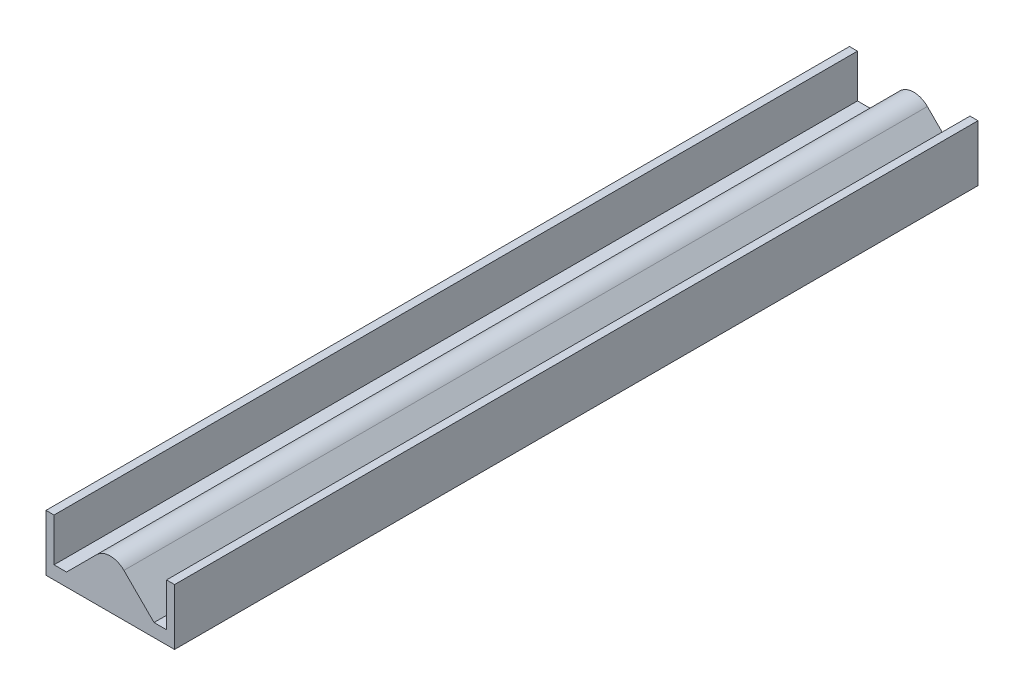
ISO-10303-21;
HEADER;
FILE_DESCRIPTION(('STEP AP214'),'2;1');
FILE_NAME('part.step','',(''),(''),'','','');
FILE_SCHEMA(('AUTOMOTIVE_DESIGN { 1 0 10303 214 1 1 1 1 }'));
ENDSEC;
DATA;
#1=APPLICATION_CONTEXT('core data for automotive mechanical design processes');
#2=APPLICATION_PROTOCOL_DEFINITION('international standard','automotive_design',2000,#1);
#3=PRODUCT_CONTEXT('',#1,'mechanical');
#4=PRODUCT('Part','Part','',(#3));
#5=PRODUCT_RELATED_PRODUCT_CATEGORY('part','',(#4));
#6=PRODUCT_DEFINITION_FORMATION('','',#4);
#7=PRODUCT_DEFINITION_CONTEXT('part definition',#1,'design');
#8=PRODUCT_DEFINITION('design','',#6,#7);
#9=PRODUCT_DEFINITION_SHAPE('','',#8);
#10=(LENGTH_UNIT() NAMED_UNIT(*) SI_UNIT(.MILLI.,.METRE.));
#11=(NAMED_UNIT(*) PLANE_ANGLE_UNIT() SI_UNIT($,.RADIAN.));
#12=(NAMED_UNIT(*) SI_UNIT($,.STERADIAN.) SOLID_ANGLE_UNIT());
#13=UNCERTAINTY_MEASURE_WITH_UNIT(LENGTH_MEASURE(1.E-05),#10,'distance_accuracy_value','');
#14=(GEOMETRIC_REPRESENTATION_CONTEXT(3) GLOBAL_UNCERTAINTY_ASSIGNED_CONTEXT((#13)) GLOBAL_UNIT_ASSIGNED_CONTEXT((#10,
#11,#12)) REPRESENTATION_CONTEXT('',''));
#15=CARTESIAN_POINT('',(0.,0.,0.));
#16=DIRECTION('',(0.,0.,1.));
#17=DIRECTION('',(1.,0.,0.));
#18=AXIS2_PLACEMENT_3D('',#15,#16,#17);
#19=CARTESIAN_POINT('',(40.,-18.75,500.));
#20=DIRECTION('',(0.,1.,0.));
#21=DIRECTION('',(-1.,0.,0.));
#22=AXIS2_PLACEMENT_3D('',#19,#20,#21);
#23=PLANE('',#22);
#24=DIRECTION('',(1.,0.,0.));
#25=VECTOR('',#24,1.);
#26=CARTESIAN_POINT('',(40.,-18.75,0.));
#27=LINE('',#26,#25);
#28=CARTESIAN_POINT('',(-40.,-18.75,0.));
#29=VERTEX_POINT('',#28);
#30=CARTESIAN_POINT('',(40.,-18.75,0.));
#31=VERTEX_POINT('',#30);
#32=EDGE_CURVE('E145',#29,#31,#27,.T.);
#33=ORIENTED_EDGE('',*,*,#32,.T.);
#34=DIRECTION('',(0.,0.,-1.));
#35=VECTOR('',#34,1.);
#36=CARTESIAN_POINT('',(40.,-18.75,500.));
#37=LINE('',#36,#35);
#38=CARTESIAN_POINT('',(40.,-18.75,500.));
#39=VERTEX_POINT('',#38);
#40=EDGE_CURVE('E126',#39,#31,#37,.T.);
#41=ORIENTED_EDGE('',*,*,#40,.F.);
#42=DIRECTION('',(1.,0.,0.));
#43=VECTOR('',#42,1.);
#44=CARTESIAN_POINT('',(40.,-18.75,500.));
#45=LINE('',#44,#43);
#46=CARTESIAN_POINT('',(-40.,-18.75,500.));
#47=VERTEX_POINT('',#46);
#48=EDGE_CURVE('E133',#47,#39,#45,.T.);
#49=ORIENTED_EDGE('',*,*,#48,.F.);
#50=DIRECTION('',(0.,0.,-1.));
#51=VECTOR('',#50,1.);
#52=CARTESIAN_POINT('',(-40.,-18.75,500.));
#53=LINE('',#52,#51);
#54=EDGE_CURVE('E174',#47,#29,#53,.T.);
#55=ORIENTED_EDGE('',*,*,#54,.T.);
#56=EDGE_LOOP('',(#33,#41,#49,#55));
#57=FACE_BOUND('',#56,.T.);
#58=ADVANCED_FACE('F33',(#57),#23,.F.);
#59=CARTESIAN_POINT('',(40.,16.25,500.));
#60=DIRECTION('',(-1.,0.,0.));
#61=DIRECTION('',(0.,-1.,0.));
#62=AXIS2_PLACEMENT_3D('',#59,#60,#61);
#63=PLANE('',#62);
#64=DIRECTION('',(0.,1.,0.));
#65=VECTOR('',#64,1.);
#66=CARTESIAN_POINT('',(40.,16.25,0.));
#67=LINE('',#66,#65);
#68=CARTESIAN_POINT('',(40.,16.25,0.));
#69=VERTEX_POINT('',#68);
#70=EDGE_CURVE('E193',#31,#69,#67,.T.);
#71=ORIENTED_EDGE('',*,*,#70,.T.);
#72=DIRECTION('',(0.,0.,-1.));
#73=VECTOR('',#72,1.);
#74=CARTESIAN_POINT('',(40.,16.25,500.));
#75=LINE('',#74,#73);
#76=CARTESIAN_POINT('',(40.,16.25,500.));
#77=VERTEX_POINT('',#76);
#78=EDGE_CURVE('E129',#77,#69,#75,.T.);
#79=ORIENTED_EDGE('',*,*,#78,.F.);
#80=DIRECTION('',(0.,1.,0.));
#81=VECTOR('',#80,1.);
#82=CARTESIAN_POINT('',(40.,16.25,500.));
#83=LINE('',#82,#81);
#84=EDGE_CURVE('E122',#39,#77,#83,.T.);
#85=ORIENTED_EDGE('',*,*,#84,.F.);
#86=ORIENTED_EDGE('',*,*,#40,.T.);
#87=EDGE_LOOP('',(#71,#79,#85,#86));
#88=FACE_BOUND('',#87,.T.);
#89=ADVANCED_FACE('F124',(#88),#63,.F.);
#90=CARTESIAN_POINT('',(35.,16.25,500.));
#91=DIRECTION('',(0.,-1.,0.));
#92=DIRECTION('',(0.,0.,-1.));
#93=AXIS2_PLACEMENT_3D('',#90,#91,#92);
#94=PLANE('',#93);
#95=DIRECTION('',(-1.,0.,0.));
#96=VECTOR('',#95,1.);
#97=CARTESIAN_POINT('',(35.,16.25,0.));
#98=LINE('',#97,#96);
#99=CARTESIAN_POINT('',(35.,16.25,0.));
#100=VERTEX_POINT('',#99);
#101=EDGE_CURVE('E191',#69,#100,#98,.T.);
#102=ORIENTED_EDGE('',*,*,#101,.T.);
#103=DIRECTION('',(0.,0.,-1.));
#104=VECTOR('',#103,1.);
#105=CARTESIAN_POINT('',(35.,16.25,500.));
#106=LINE('',#105,#104);
#107=CARTESIAN_POINT('',(35.,16.25,500.));
#108=VERTEX_POINT('',#107);
#109=EDGE_CURVE('E150',#108,#100,#106,.T.);
#110=ORIENTED_EDGE('',*,*,#109,.F.);
#111=DIRECTION('',(-1.,0.,0.));
#112=VECTOR('',#111,1.);
#113=CARTESIAN_POINT('',(35.,16.25,500.));
#114=LINE('',#113,#112);
#115=EDGE_CURVE('E132',#77,#108,#114,.T.);
#116=ORIENTED_EDGE('',*,*,#115,.F.);
#117=ORIENTED_EDGE('',*,*,#78,.T.);
#118=EDGE_LOOP('',(#102,#110,#116,#117));
#119=FACE_BOUND('',#118,.T.);
#120=ADVANCED_FACE('F215',(#119),#94,.F.);
#121=CARTESIAN_POINT('',(35.,16.25,500.));
#122=DIRECTION('',(1.,0.,0.));
#123=DIRECTION('',(0.,0.,-1.));
#124=AXIS2_PLACEMENT_3D('',#121,#122,#123);
#125=PLANE('',#124);
#126=DIRECTION('',(0.,-1.,0.));
#127=VECTOR('',#126,1.);
#128=CARTESIAN_POINT('',(35.,16.25,0.));
#129=LINE('',#128,#127);
#130=CARTESIAN_POINT('',(35.,-10.5949314192417,0.));
#131=VERTEX_POINT('',#130);
#132=EDGE_CURVE('E189',#100,#131,#129,.T.);
#133=ORIENTED_EDGE('',*,*,#132,.T.);
#134=DIRECTION('',(0.,0.,-1.));
#135=VECTOR('',#134,1.);
#136=CARTESIAN_POINT('',(35.,-10.5949314192417,500.));
#137=LINE('',#136,#135);
#138=CARTESIAN_POINT('',(35.,-10.5949314192417,500.));
#139=VERTEX_POINT('',#138);
#140=EDGE_CURVE('E156',#139,#131,#137,.T.);
#141=ORIENTED_EDGE('',*,*,#140,.F.);
#142=DIRECTION('',(0.,-1.,0.));
#143=VECTOR('',#142,1.);
#144=CARTESIAN_POINT('',(35.,16.25,500.));
#145=LINE('',#144,#143);
#146=EDGE_CURVE('E209',#108,#139,#145,.T.);
#147=ORIENTED_EDGE('',*,*,#146,.F.);
#148=ORIENTED_EDGE('',*,*,#109,.T.);
#149=EDGE_LOOP('',(#133,#141,#147,#148));
#150=FACE_BOUND('',#149,.T.);
#151=ADVANCED_FACE('F219',(#150),#125,.F.);
#152=CARTESIAN_POINT('',(35.,-10.5949314192417,500.));
#153=DIRECTION('',(0.,-1.,0.));
#154=DIRECTION('',(0.,0.,-1.));
#155=AXIS2_PLACEMENT_3D('',#152,#153,#154);
#156=PLANE('',#155);
#157=DIRECTION('',(-1.,0.,0.));
#158=VECTOR('',#157,1.);
#159=CARTESIAN_POINT('',(35.,-10.5949314192417,0.));
#160=LINE('',#159,#158);
#161=CARTESIAN_POINT('',(27.2236110756821,-10.5949314192417,0.));
#162=VERTEX_POINT('',#161);
#163=EDGE_CURVE('E187',#131,#162,#160,.T.);
#164=ORIENTED_EDGE('',*,*,#163,.T.);
#165=DIRECTION('',(0.,0.,-1.));
#166=VECTOR('',#165,1.);
#167=CARTESIAN_POINT('',(27.2236110756821,-10.5949314192417,500.));
#168=LINE('',#167,#166);
#169=CARTESIAN_POINT('',(27.2236110756821,-10.5949314192417,500.));
#170=VERTEX_POINT('',#169);
#171=EDGE_CURVE('E159',#170,#162,#168,.T.);
#172=ORIENTED_EDGE('',*,*,#171,.F.);
#173=DIRECTION('',(-1.,0.,0.));
#174=VECTOR('',#173,1.);
#175=CARTESIAN_POINT('',(35.,-10.5949314192417,500.));
#176=LINE('',#175,#174);
#177=EDGE_CURVE('E207',#139,#170,#176,.T.);
#178=ORIENTED_EDGE('',*,*,#177,.F.);
#179=ORIENTED_EDGE('',*,*,#140,.T.);
#180=EDGE_LOOP('',(#164,#172,#178,#179));
#181=FACE_BOUND('',#180,.T.);
#182=ADVANCED_FACE('F224',(#181),#156,.F.);
#183=CARTESIAN_POINT('',(0.,16.6286796564404,500.));
#184=DIRECTION('',(-0.707106781186548,-0.707106781186548,0.));
#185=DIRECTION('',(0.707106781186548,-0.707106781186548,0.));
#186=AXIS2_PLACEMENT_3D('',#183,#184,#185);
#187=PLANE('',#186);
#188=DIRECTION('',(-0.707106781186547,0.707106781186547,0.));
#189=VECTOR('',#188,1.);
#190=CARTESIAN_POINT('',(0.,16.6286796564404,0.));
#191=LINE('',#190,#189);
#192=CARTESIAN_POINT('',(8.48528137423868,8.14339828220171,0.));
#193=VERTEX_POINT('',#192);
#194=EDGE_CURVE('E185',#162,#193,#191,.T.);
#195=ORIENTED_EDGE('',*,*,#194,.T.);
#196=DIRECTION('',(0.,0.,-1.));
#197=VECTOR('',#196,1.);
#198=CARTESIAN_POINT('',(8.48528137423868,8.14339828220171,500.));
#199=LINE('',#198,#197);
#200=CARTESIAN_POINT('',(8.48528137423868,8.14339828220171,500.));
#201=VERTEX_POINT('',#200);
#202=EDGE_CURVE('E41',#193,#201,#199,.F.);
#203=ORIENTED_EDGE('',*,*,#202,.T.);
#204=DIRECTION('',(-0.707106781186547,0.707106781186547,0.));
#205=VECTOR('',#204,1.);
#206=CARTESIAN_POINT('',(0.,16.6286796564404,500.));
#207=LINE('',#206,#205);
#208=EDGE_CURVE('E205',#170,#201,#207,.T.);
#209=ORIENTED_EDGE('',*,*,#208,.F.);
#210=ORIENTED_EDGE('',*,*,#171,.T.);
#211=EDGE_LOOP('',(#195,#203,#209,#210));
#212=FACE_BOUND('',#211,.T.);
#213=ADVANCED_FACE('F251',(#212),#187,.F.);
#214=CARTESIAN_POINT('',(0.,16.6286796564404,500.));
#215=DIRECTION('',(0.707106781186554,-0.707106781186541,0.));
#216=DIRECTION('',(0.707106781186541,0.707106781186554,0.));
#217=AXIS2_PLACEMENT_3D('',#214,#215,#216);
#218=PLANE('',#217);
#219=DIRECTION('',(-0.707106781186541,-0.707106781186554,0.));
#220=VECTOR('',#219,1.);
#221=CARTESIAN_POINT('',(0.,16.6286796564404,500.));
#222=LINE('',#221,#220);
#223=CARTESIAN_POINT('',(-8.48528137423853,8.14339828220163,500.));
#224=VERTEX_POINT('',#223);
#225=CARTESIAN_POINT('',(-27.2236110756818,-10.594931419242,500.));
#226=VERTEX_POINT('',#225);
#227=EDGE_CURVE('E203',#224,#226,#222,.T.);
#228=ORIENTED_EDGE('',*,*,#227,.F.);
#229=DIRECTION('',(0.,0.,-1.));
#230=VECTOR('',#229,1.);
#231=CARTESIAN_POINT('',(-8.48528137423854,8.14339828220163,500.));
#232=LINE('',#231,#230);
#233=CARTESIAN_POINT('',(-8.48528137423853,8.14339828220163,0.));
#234=VERTEX_POINT('',#233);
#235=EDGE_CURVE('E146',#224,#234,#232,.T.);
#236=ORIENTED_EDGE('',*,*,#235,.T.);
#237=DIRECTION('',(-0.707106781186541,-0.707106781186554,0.));
#238=VECTOR('',#237,1.);
#239=CARTESIAN_POINT('',(0.,16.6286796564404,0.));
#240=LINE('',#239,#238);
#241=CARTESIAN_POINT('',(-27.2236110756818,-10.594931419242,0.));
#242=VERTEX_POINT('',#241);
#243=EDGE_CURVE('E183',#234,#242,#240,.T.);
#244=ORIENTED_EDGE('',*,*,#243,.T.);
#245=DIRECTION('',(0.,0.,-1.));
#246=VECTOR('',#245,1.);
#247=CARTESIAN_POINT('',(-27.2236110756818,-10.594931419242,500.));
#248=LINE('',#247,#246);
#249=EDGE_CURVE('E162',#226,#242,#248,.T.);
#250=ORIENTED_EDGE('',*,*,#249,.F.);
#251=EDGE_LOOP('',(#228,#236,#244,#250));
#252=FACE_BOUND('',#251,.T.);
#253=ADVANCED_FACE('F230',(#252),#218,.F.);
#254=CARTESIAN_POINT('',(-35.,-10.594931419242,500.));
#255=DIRECTION('',(0.,-1.,0.));
#256=DIRECTION('',(0.,0.,-1.));
#257=AXIS2_PLACEMENT_3D('',#254,#255,#256);
#258=PLANE('',#257);
#259=DIRECTION('',(-1.,0.,0.));
#260=VECTOR('',#259,1.);
#261=CARTESIAN_POINT('',(-35.,-10.594931419242,0.));
#262=LINE('',#261,#260);
#263=CARTESIAN_POINT('',(-35.,-10.594931419242,0.));
#264=VERTEX_POINT('',#263);
#265=EDGE_CURVE('E181',#242,#264,#262,.T.);
#266=ORIENTED_EDGE('',*,*,#265,.T.);
#267=DIRECTION('',(0.,0.,-1.));
#268=VECTOR('',#267,1.);
#269=CARTESIAN_POINT('',(-35.,-10.594931419242,500.));
#270=LINE('',#269,#268);
#271=CARTESIAN_POINT('',(-35.,-10.594931419242,500.));
#272=VERTEX_POINT('',#271);
#273=EDGE_CURVE('E165',#272,#264,#270,.T.);
#274=ORIENTED_EDGE('',*,*,#273,.F.);
#275=DIRECTION('',(-1.,0.,0.));
#276=VECTOR('',#275,1.);
#277=CARTESIAN_POINT('',(-35.,-10.594931419242,500.));
#278=LINE('',#277,#276);
#279=EDGE_CURVE('E201',#226,#272,#278,.T.);
#280=ORIENTED_EDGE('',*,*,#279,.F.);
#281=ORIENTED_EDGE('',*,*,#249,.T.);
#282=EDGE_LOOP('',(#266,#274,#280,#281));
#283=FACE_BOUND('',#282,.T.);
#284=ADVANCED_FACE('F238',(#283),#258,.F.);
#285=CARTESIAN_POINT('',(-35.,16.25,500.));
#286=DIRECTION('',(-1.,0.,0.));
#287=DIRECTION('',(0.,0.,1.));
#288=AXIS2_PLACEMENT_3D('',#285,#286,#287);
#289=PLANE('',#288);
#290=DIRECTION('',(0.,1.,0.));
#291=VECTOR('',#290,1.);
#292=CARTESIAN_POINT('',(-35.,16.25,0.));
#293=LINE('',#292,#291);
#294=CARTESIAN_POINT('',(-35.,16.25,0.));
#295=VERTEX_POINT('',#294);
#296=EDGE_CURVE('E179',#264,#295,#293,.T.);
#297=ORIENTED_EDGE('',*,*,#296,.T.);
#298=DIRECTION('',(0.,0.,-1.));
#299=VECTOR('',#298,1.);
#300=CARTESIAN_POINT('',(-35.,16.25,500.));
#301=LINE('',#300,#299);
#302=CARTESIAN_POINT('',(-35.,16.25,500.));
#303=VERTEX_POINT('',#302);
#304=EDGE_CURVE('E168',#303,#295,#301,.T.);
#305=ORIENTED_EDGE('',*,*,#304,.F.);
#306=DIRECTION('',(0.,1.,0.));
#307=VECTOR('',#306,1.);
#308=CARTESIAN_POINT('',(-35.,16.25,500.));
#309=LINE('',#308,#307);
#310=EDGE_CURVE('E199',#272,#303,#309,.T.);
#311=ORIENTED_EDGE('',*,*,#310,.F.);
#312=ORIENTED_EDGE('',*,*,#273,.T.);
#313=EDGE_LOOP('',(#297,#305,#311,#312));
#314=FACE_BOUND('',#313,.T.);
#315=ADVANCED_FACE('F242',(#314),#289,.F.);
#316=CARTESIAN_POINT('',(-35.,16.25,500.));
#317=DIRECTION('',(0.,-1.,0.));
#318=DIRECTION('',(0.,0.,-1.));
#319=AXIS2_PLACEMENT_3D('',#316,#317,#318);
#320=PLANE('',#319);
#321=DIRECTION('',(-1.,0.,0.));
#322=VECTOR('',#321,1.);
#323=CARTESIAN_POINT('',(-35.,16.25,0.));
#324=LINE('',#323,#322);
#325=CARTESIAN_POINT('',(-40.,16.25,0.));
#326=VERTEX_POINT('',#325);
#327=EDGE_CURVE('E177',#295,#326,#324,.T.);
#328=ORIENTED_EDGE('',*,*,#327,.T.);
#329=DIRECTION('',(0.,0.,-1.));
#330=VECTOR('',#329,1.);
#331=CARTESIAN_POINT('',(-40.,16.25,500.));
#332=LINE('',#331,#330);
#333=CARTESIAN_POINT('',(-40.,16.25,500.));
#334=VERTEX_POINT('',#333);
#335=EDGE_CURVE('E171',#334,#326,#332,.T.);
#336=ORIENTED_EDGE('',*,*,#335,.F.);
#337=DIRECTION('',(-1.,0.,0.));
#338=VECTOR('',#337,1.);
#339=CARTESIAN_POINT('',(-35.,16.25,500.));
#340=LINE('',#339,#338);
#341=EDGE_CURVE('E197',#303,#334,#340,.T.);
#342=ORIENTED_EDGE('',*,*,#341,.F.);
#343=ORIENTED_EDGE('',*,*,#304,.T.);
#344=EDGE_LOOP('',(#328,#336,#342,#343));
#345=FACE_BOUND('',#344,.T.);
#346=ADVANCED_FACE('F247',(#345),#320,.F.);
#347=CARTESIAN_POINT('',(-40.,16.25,500.));
#348=DIRECTION('',(1.,0.,0.));
#349=DIRECTION('',(0.,1.,0.));
#350=AXIS2_PLACEMENT_3D('',#347,#348,#349);
#351=PLANE('',#350);
#352=DIRECTION('',(0.,-1.,0.));
#353=VECTOR('',#352,1.);
#354=CARTESIAN_POINT('',(-40.,16.25,0.));
#355=LINE('',#354,#353);
#356=EDGE_CURVE('E142',#326,#29,#355,.T.);
#357=ORIENTED_EDGE('',*,*,#356,.T.);
#358=ORIENTED_EDGE('',*,*,#54,.F.);
#359=DIRECTION('',(0.,-1.,0.));
#360=VECTOR('',#359,1.);
#361=CARTESIAN_POINT('',(-40.,16.25,500.));
#362=LINE('',#361,#360);
#363=EDGE_CURVE('E138',#334,#47,#362,.T.);
#364=ORIENTED_EDGE('',*,*,#363,.F.);
#365=ORIENTED_EDGE('',*,*,#335,.T.);
#366=EDGE_LOOP('',(#357,#358,#364,#365));
#367=FACE_BOUND('',#366,.T.);
#368=ADVANCED_FACE('F250',(#367),#351,.F.);
#369=CARTESIAN_POINT('',(0.,0.,500.));
#370=DIRECTION('',(0.,0.,1.));
#371=DIRECTION('',(1.,0.,0.));
#372=AXIS2_PLACEMENT_3D('',#369,#370,#371);
#373=PLANE('',#372);
#374=ORIENTED_EDGE('',*,*,#208,.T.);
#375=CARTESIAN_POINT('',(1.11022302462516E-13,-0.341883092036865,500.));
#376=DIRECTION('',(0.,0.,1.));
#377=DIRECTION('',(1.,0.,0.));
#378=AXIS2_PLACEMENT_3D('',#375,#376,#377);
#379=CIRCLE('',#378,12.);
#380=EDGE_CURVE('E11',#201,#224,#379,.T.);
#381=ORIENTED_EDGE('',*,*,#380,.T.);
#382=ORIENTED_EDGE('',*,*,#227,.T.);
#383=ORIENTED_EDGE('',*,*,#279,.T.);
#384=ORIENTED_EDGE('',*,*,#310,.T.);
#385=ORIENTED_EDGE('',*,*,#341,.T.);
#386=ORIENTED_EDGE('',*,*,#363,.T.);
#387=ORIENTED_EDGE('',*,*,#48,.T.);
#388=ORIENTED_EDGE('',*,*,#84,.T.);
#389=ORIENTED_EDGE('',*,*,#115,.T.);
#390=ORIENTED_EDGE('',*,*,#146,.T.);
#391=ORIENTED_EDGE('',*,*,#177,.T.);
#392=EDGE_LOOP('',(#374,#381,#382,#383,#384,#385,#386,#387,#388,#389,#390,#391));
#393=FACE_BOUND('',#392,.T.);
#394=ADVANCED_FACE('F136',(#393),#373,.T.);
#395=CARTESIAN_POINT('',(0.,0.,0.));
#396=DIRECTION('',(0.,0.,1.));
#397=DIRECTION('',(1.,0.,0.));
#398=AXIS2_PLACEMENT_3D('',#395,#396,#397);
#399=PLANE('',#398);
#400=ORIENTED_EDGE('',*,*,#243,.F.);
#401=CARTESIAN_POINT('',(1.11022302462516E-13,-0.341883092036865,0.));
#402=DIRECTION('',(0.,0.,1.));
#403=DIRECTION('',(1.,0.,0.));
#404=AXIS2_PLACEMENT_3D('',#401,#402,#403);
#405=CIRCLE('',#404,12.);
#406=EDGE_CURVE('E55',#234,#193,#405,.F.);
#407=ORIENTED_EDGE('',*,*,#406,.T.);
#408=ORIENTED_EDGE('',*,*,#194,.F.);
#409=ORIENTED_EDGE('',*,*,#163,.F.);
#410=ORIENTED_EDGE('',*,*,#132,.F.);
#411=ORIENTED_EDGE('',*,*,#101,.F.);
#412=ORIENTED_EDGE('',*,*,#70,.F.);
#413=ORIENTED_EDGE('',*,*,#32,.F.);
#414=ORIENTED_EDGE('',*,*,#356,.F.);
#415=ORIENTED_EDGE('',*,*,#327,.F.);
#416=ORIENTED_EDGE('',*,*,#296,.F.);
#417=ORIENTED_EDGE('',*,*,#265,.F.);
#418=EDGE_LOOP('',(#400,#407,#408,#409,#410,#411,#412,#413,#414,#415,#416,#417));
#419=FACE_BOUND('',#418,.T.);
#420=ADVANCED_FACE('F233',(#419),#399,.F.);
#421=CARTESIAN_POINT('',(1.11022302462516E-13,-0.341883092036865,500.));
#422=DIRECTION('',(0.,0.,-1.));
#423=DIRECTION('',(-1.,0.,0.));
#424=AXIS2_PLACEMENT_3D('',#421,#422,#423);
#425=CYLINDRICAL_SURFACE('',#424,12.);
#426=ORIENTED_EDGE('',*,*,#380,.F.);
#427=ORIENTED_EDGE('',*,*,#202,.F.);
#428=ORIENTED_EDGE('',*,*,#406,.F.);
#429=ORIENTED_EDGE('',*,*,#235,.F.);
#430=EDGE_LOOP('',(#426,#427,#428,#429));
#431=FACE_BOUND('',#430,.T.);
#432=ADVANCED_FACE('F35',(#431),#425,.T.);
#433=CLOSED_SHELL('',(#58,#89,#120,#151,#182,#213,#253,#284,#315,#346,#368,#394,#420,#432));
#434=MANIFOLD_SOLID_BREP('B2',#433);
#435=ADVANCED_BREP_SHAPE_REPRESENTATION('',(#18,#434),#14);
#436=SHAPE_DEFINITION_REPRESENTATION(#9,#435);
ENDSEC;
END-ISO-10303-21;
